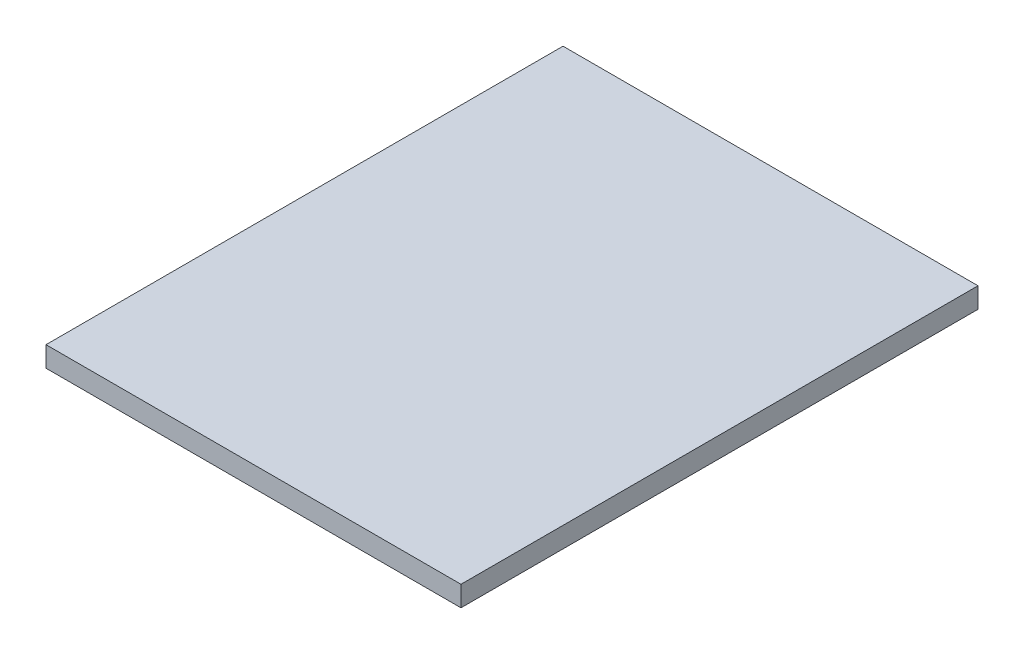
ISO-10303-21;
HEADER;
FILE_DESCRIPTION(('STEP AP214'),'2;1');
FILE_NAME('part.step','',(''),(''),'','','');
FILE_SCHEMA(('AUTOMOTIVE_DESIGN { 1 0 10303 214 1 1 1 1 }'));
ENDSEC;
DATA;
#1=APPLICATION_CONTEXT('core data for automotive mechanical design processes');
#2=APPLICATION_PROTOCOL_DEFINITION('international standard','automotive_design',2000,#1);
#3=PRODUCT_CONTEXT('',#1,'mechanical');
#4=PRODUCT('Part','Part','',(#3));
#5=PRODUCT_RELATED_PRODUCT_CATEGORY('part','',(#4));
#6=PRODUCT_DEFINITION_FORMATION('','',#4);
#7=PRODUCT_DEFINITION_CONTEXT('part definition',#1,'design');
#8=PRODUCT_DEFINITION('design','',#6,#7);
#9=PRODUCT_DEFINITION_SHAPE('','',#8);
#10=(LENGTH_UNIT() NAMED_UNIT(*) SI_UNIT(.MILLI.,.METRE.));
#11=(NAMED_UNIT(*) PLANE_ANGLE_UNIT() SI_UNIT($,.RADIAN.));
#12=(NAMED_UNIT(*) SI_UNIT($,.STERADIAN.) SOLID_ANGLE_UNIT());
#13=UNCERTAINTY_MEASURE_WITH_UNIT(LENGTH_MEASURE(1.E-05),#10,'distance_accuracy_value','');
#14=(GEOMETRIC_REPRESENTATION_CONTEXT(3) GLOBAL_UNCERTAINTY_ASSIGNED_CONTEXT((#13)) GLOBAL_UNIT_ASSIGNED_CONTEXT((#10,
#11,#12)) REPRESENTATION_CONTEXT('',''));
#15=CARTESIAN_POINT('',(0.,0.,0.));
#16=DIRECTION('',(0.,0.,1.));
#17=DIRECTION('',(1.,0.,0.));
#18=AXIS2_PLACEMENT_3D('',#15,#16,#17);
#19=CARTESIAN_POINT('',(96.8375,4.7625,-120.65));
#20=DIRECTION('',(-1.,0.,0.));
#21=DIRECTION('',(0.,0.,1.));
#22=AXIS2_PLACEMENT_3D('',#19,#20,#21);
#23=PLANE('',#22);
#24=DIRECTION('',(0.,0.,-1.));
#25=VECTOR('',#24,1.);
#26=CARTESIAN_POINT('',(96.8375,-4.7625,-120.65));
#27=LINE('',#26,#25);
#28=CARTESIAN_POINT('',(96.8375,-4.7625,120.65));
#29=VERTEX_POINT('',#28);
#30=CARTESIAN_POINT('',(96.8375,-4.7625,-120.65));
#31=VERTEX_POINT('',#30);
#32=EDGE_CURVE('E96',#29,#31,#27,.T.);
#33=ORIENTED_EDGE('',*,*,#32,.T.);
#34=DIRECTION('',(0.,-1.,0.));
#35=VECTOR('',#34,1.);
#36=CARTESIAN_POINT('',(96.8375,4.7625,-120.65));
#37=LINE('',#36,#35);
#38=CARTESIAN_POINT('',(96.8375,4.7625,-120.65));
#39=VERTEX_POINT('',#38);
#40=EDGE_CURVE('E11',#39,#31,#37,.T.);
#41=ORIENTED_EDGE('',*,*,#40,.F.);
#42=DIRECTION('',(0.,0.,-1.));
#43=VECTOR('',#42,1.);
#44=CARTESIAN_POINT('',(96.8375,4.7625,-120.65));
#45=LINE('',#44,#43);
#46=CARTESIAN_POINT('',(96.8375,4.7625,120.65));
#47=VERTEX_POINT('',#46);
#48=EDGE_CURVE('E84',#47,#39,#45,.T.);
#49=ORIENTED_EDGE('',*,*,#48,.F.);
#50=DIRECTION('',(0.,-1.,0.));
#51=VECTOR('',#50,1.);
#52=CARTESIAN_POINT('',(96.8375,4.7625,120.65));
#53=LINE('',#52,#51);
#54=EDGE_CURVE('E92',#47,#29,#53,.T.);
#55=ORIENTED_EDGE('',*,*,#54,.T.);
#56=EDGE_LOOP('',(#33,#41,#49,#55));
#57=FACE_BOUND('',#56,.T.);
#58=ADVANCED_FACE('F33',(#57),#23,.F.);
#59=CARTESIAN_POINT('',(-96.8375,4.7625,-120.65));
#60=DIRECTION('',(0.,0.,1.));
#61=DIRECTION('',(1.,0.,0.));
#62=AXIS2_PLACEMENT_3D('',#59,#60,#61);
#63=PLANE('',#62);
#64=DIRECTION('',(-1.,0.,0.));
#65=VECTOR('',#64,1.);
#66=CARTESIAN_POINT('',(-96.8375,-4.7625,-120.65));
#67=LINE('',#66,#65);
#68=CARTESIAN_POINT('',(-96.8375,-4.7625,-120.65));
#69=VERTEX_POINT('',#68);
#70=EDGE_CURVE('E88',#31,#69,#67,.T.);
#71=ORIENTED_EDGE('',*,*,#70,.T.);
#72=DIRECTION('',(0.,-1.,0.));
#73=VECTOR('',#72,1.);
#74=CARTESIAN_POINT('',(-96.8375,4.7625,-120.65));
#75=LINE('',#74,#73);
#76=CARTESIAN_POINT('',(-96.8375,4.7625,-120.65));
#77=VERTEX_POINT('',#76);
#78=EDGE_CURVE('E41',#77,#69,#75,.T.);
#79=ORIENTED_EDGE('',*,*,#78,.F.);
#80=DIRECTION('',(-1.,0.,0.));
#81=VECTOR('',#80,1.);
#82=CARTESIAN_POINT('',(-96.8375,4.7625,-120.65));
#83=LINE('',#82,#81);
#84=EDGE_CURVE('E79',#39,#77,#83,.T.);
#85=ORIENTED_EDGE('',*,*,#84,.F.);
#86=ORIENTED_EDGE('',*,*,#40,.T.);
#87=EDGE_LOOP('',(#71,#79,#85,#86));
#88=FACE_BOUND('',#87,.T.);
#89=ADVANCED_FACE('F87',(#88),#63,.F.);
#90=CARTESIAN_POINT('',(-96.8375,4.7625,-120.65));
#91=DIRECTION('',(1.,0.,0.));
#92=DIRECTION('',(0.,0.,-1.));
#93=AXIS2_PLACEMENT_3D('',#90,#91,#92);
#94=PLANE('',#93);
#95=DIRECTION('',(0.,0.,1.));
#96=VECTOR('',#95,1.);
#97=CARTESIAN_POINT('',(-96.8375,-4.7625,-120.65));
#98=LINE('',#97,#96);
#99=CARTESIAN_POINT('',(-96.8374999999999,-4.7625,120.65));
#100=VERTEX_POINT('',#99);
#101=EDGE_CURVE('E66',#69,#100,#98,.T.);
#102=ORIENTED_EDGE('',*,*,#101,.T.);
#103=DIRECTION('',(0.,-1.,0.));
#104=VECTOR('',#103,1.);
#105=CARTESIAN_POINT('',(-96.8374999999999,4.7625,120.65));
#106=LINE('',#105,#104);
#107=CARTESIAN_POINT('',(-96.8374999999999,4.7625,120.65));
#108=VERTEX_POINT('',#107);
#109=EDGE_CURVE('E89',#108,#100,#106,.T.);
#110=ORIENTED_EDGE('',*,*,#109,.F.);
#111=DIRECTION('',(0.,0.,1.));
#112=VECTOR('',#111,1.);
#113=CARTESIAN_POINT('',(-96.8375,4.7625,-120.65));
#114=LINE('',#113,#112);
#115=EDGE_CURVE('E82',#77,#108,#114,.T.);
#116=ORIENTED_EDGE('',*,*,#115,.F.);
#117=ORIENTED_EDGE('',*,*,#78,.T.);
#118=EDGE_LOOP('',(#102,#110,#116,#117));
#119=FACE_BOUND('',#118,.T.);
#120=ADVANCED_FACE('F90',(#119),#94,.F.);
#121=CARTESIAN_POINT('',(-96.8374999999999,4.7625,120.65));
#122=DIRECTION('',(0.,0.,-1.));
#123=DIRECTION('',(-1.,0.,0.));
#124=AXIS2_PLACEMENT_3D('',#121,#122,#123);
#125=PLANE('',#124);
#126=DIRECTION('',(1.,0.,0.));
#127=VECTOR('',#126,1.);
#128=CARTESIAN_POINT('',(-96.8374999999999,-4.7625,120.65));
#129=LINE('',#128,#127);
#130=EDGE_CURVE('E72',#100,#29,#129,.T.);
#131=ORIENTED_EDGE('',*,*,#130,.T.);
#132=ORIENTED_EDGE('',*,*,#54,.F.);
#133=DIRECTION('',(1.,0.,0.));
#134=VECTOR('',#133,1.);
#135=CARTESIAN_POINT('',(-96.8374999999999,4.7625,120.65));
#136=LINE('',#135,#134);
#137=EDGE_CURVE('E49',#108,#47,#136,.T.);
#138=ORIENTED_EDGE('',*,*,#137,.F.);
#139=ORIENTED_EDGE('',*,*,#109,.T.);
#140=EDGE_LOOP('',(#131,#132,#138,#139));
#141=FACE_BOUND('',#140,.T.);
#142=ADVANCED_FACE('F103',(#141),#125,.F.);
#143=CARTESIAN_POINT('',(0.,4.7625,0.));
#144=DIRECTION('',(0.,1.,0.));
#145=DIRECTION('',(0.,0.,1.));
#146=AXIS2_PLACEMENT_3D('',#143,#144,#145);
#147=PLANE('',#146);
#148=ORIENTED_EDGE('',*,*,#48,.T.);
#149=ORIENTED_EDGE('',*,*,#84,.T.);
#150=ORIENTED_EDGE('',*,*,#115,.T.);
#151=ORIENTED_EDGE('',*,*,#137,.T.);
#152=EDGE_LOOP('',(#148,#149,#150,#151));
#153=FACE_BOUND('',#152,.T.);
#154=ADVANCED_FACE('F80',(#153),#147,.T.);
#155=CARTESIAN_POINT('',(0.,-4.7625,0.));
#156=DIRECTION('',(0.,1.,0.));
#157=DIRECTION('',(0.,0.,1.));
#158=AXIS2_PLACEMENT_3D('',#155,#156,#157);
#159=PLANE('',#158);
#160=ORIENTED_EDGE('',*,*,#32,.F.);
#161=ORIENTED_EDGE('',*,*,#130,.F.);
#162=ORIENTED_EDGE('',*,*,#101,.F.);
#163=ORIENTED_EDGE('',*,*,#70,.F.);
#164=EDGE_LOOP('',(#160,#161,#162,#163));
#165=FACE_BOUND('',#164,.T.);
#166=ADVANCED_FACE('F106',(#165),#159,.F.);
#167=CLOSED_SHELL('',(#58,#89,#120,#142,#154,#166));
#168=MANIFOLD_SOLID_BREP('B2',#167);
#169=ADVANCED_BREP_SHAPE_REPRESENTATION('',(#18,#168),#14);
#170=SHAPE_DEFINITION_REPRESENTATION(#9,#169);
ENDSEC;
END-ISO-10303-21;
